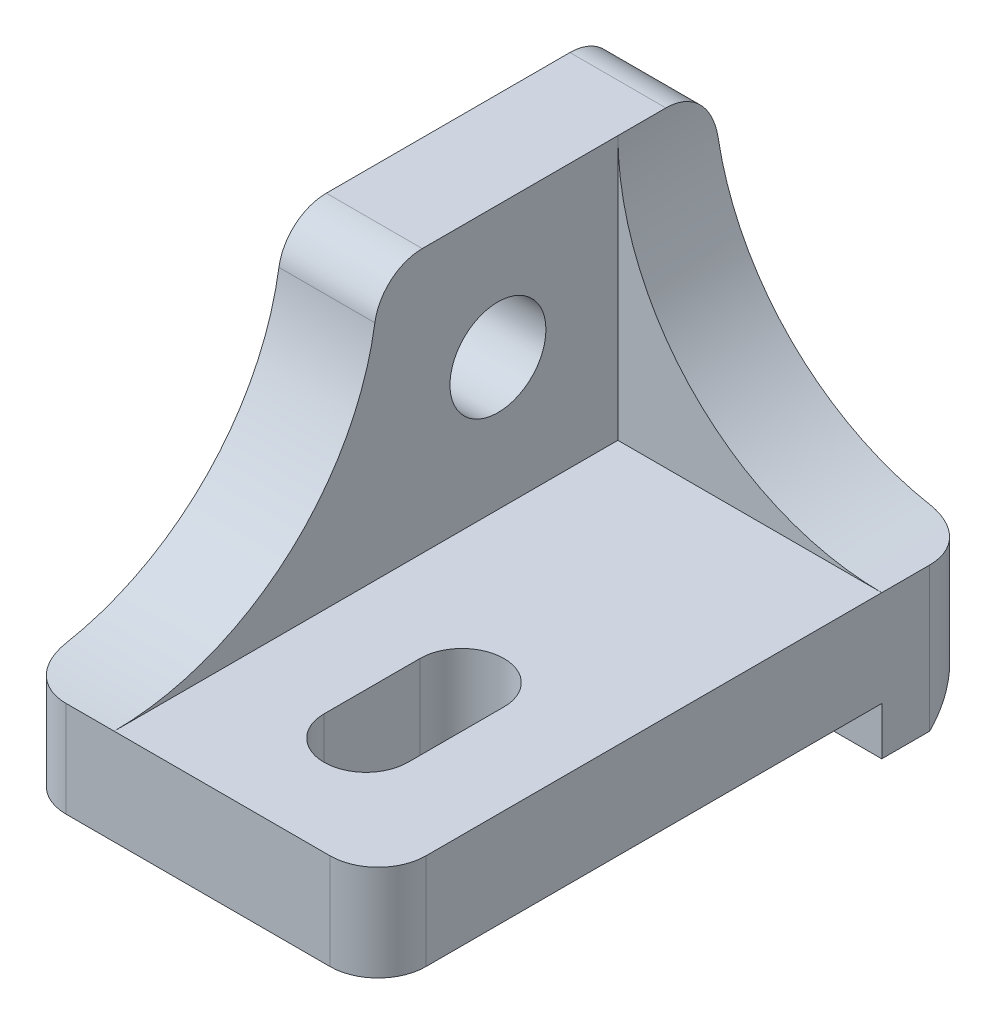
ISO-10303-21;
HEADER;
FILE_DESCRIPTION(('STEP AP214'),'2;1');
FILE_NAME('part.step','',(''),(''),'','','');
FILE_SCHEMA(('AUTOMOTIVE_DESIGN { 1 0 10303 214 1 1 1 1 }'));
ENDSEC;
DATA;
#1=APPLICATION_CONTEXT('core data for automotive mechanical design processes');
#2=APPLICATION_PROTOCOL_DEFINITION('international standard','automotive_design',2000,#1);
#3=PRODUCT_CONTEXT('',#1,'mechanical');
#4=PRODUCT('Part','Part','',(#3));
#5=PRODUCT_RELATED_PRODUCT_CATEGORY('part','',(#4));
#6=PRODUCT_DEFINITION_FORMATION('','',#4);
#7=PRODUCT_DEFINITION_CONTEXT('part definition',#1,'design');
#8=PRODUCT_DEFINITION('design','',#6,#7);
#9=PRODUCT_DEFINITION_SHAPE('','',#8);
#10=(LENGTH_UNIT() NAMED_UNIT(*) SI_UNIT(.MILLI.,.METRE.));
#11=(NAMED_UNIT(*) PLANE_ANGLE_UNIT() SI_UNIT($,.RADIAN.));
#12=(NAMED_UNIT(*) SI_UNIT($,.STERADIAN.) SOLID_ANGLE_UNIT());
#13=UNCERTAINTY_MEASURE_WITH_UNIT(LENGTH_MEASURE(1.E-05),#10,'distance_accuracy_value','');
#14=(GEOMETRIC_REPRESENTATION_CONTEXT(3) GLOBAL_UNCERTAINTY_ASSIGNED_CONTEXT((#13)) GLOBAL_UNIT_ASSIGNED_CONTEXT((#10,
#11,#12)) REPRESENTATION_CONTEXT('',''));
#15=CARTESIAN_POINT('',(0.,0.,0.));
#16=DIRECTION('',(0.,0.,1.));
#17=DIRECTION('',(1.,0.,0.));
#18=AXIS2_PLACEMENT_3D('',#15,#16,#17);
#19=CARTESIAN_POINT('',(0.,4.,25.));
#20=DIRECTION('',(-1.,0.,0.));
#21=DIRECTION('',(0.,0.,1.));
#22=AXIS2_PLACEMENT_3D('',#19,#20,#21);
#23=PLANE('',#22);
#24=DIRECTION('',(0.,0.,-1.));
#25=VECTOR('',#24,1.);
#26=CARTESIAN_POINT('',(0.,-2.,4.));
#27=LINE('',#26,#25);
#28=CARTESIAN_POINT('',(0.,-2.,4.));
#29=VERTEX_POINT('',#28);
#30=CARTESIAN_POINT('',(0.,-2.,2.));
#31=VERTEX_POINT('',#30);
#32=EDGE_CURVE('E505',#29,#31,#27,.T.);
#33=ORIENTED_EDGE('',*,*,#32,.T.);
#34=DIRECTION('',(0.,1.,0.));
#35=VECTOR('',#34,1.);
#36=CARTESIAN_POINT('',(0.,4.,2.));
#37=LINE('',#36,#35);
#38=CARTESIAN_POINT('',(0.,4.,2.));
#39=VERTEX_POINT('',#38);
#40=EDGE_CURVE('E308',#31,#39,#37,.T.);
#41=ORIENTED_EDGE('',*,*,#40,.T.);
#42=DIRECTION('',(0.,0.,-1.));
#43=VECTOR('',#42,1.);
#44=CARTESIAN_POINT('',(0.,4.,4.));
#45=LINE('',#44,#43);
#46=CARTESIAN_POINT('',(0.,4.,4.));
#47=VERTEX_POINT('',#46);
#48=EDGE_CURVE('E543',#47,#39,#45,.T.);
#49=ORIENTED_EDGE('',*,*,#48,.F.);
#50=DIRECTION('',(0.,0.,-1.));
#51=VECTOR('',#50,1.);
#52=CARTESIAN_POINT('',(0.,4.,25.));
#53=LINE('',#52,#51);
#54=CARTESIAN_POINT('',(0.,4.,23.));
#55=VERTEX_POINT('',#54);
#56=EDGE_CURVE('E241',#55,#47,#53,.T.);
#57=ORIENTED_EDGE('',*,*,#56,.F.);
#58=DIRECTION('',(0.,1.,0.));
#59=VECTOR('',#58,1.);
#60=CARTESIAN_POINT('',(0.,4.,23.));
#61=LINE('',#60,#59);
#62=CARTESIAN_POINT('',(0.,0.,23.));
#63=VERTEX_POINT('',#62);
#64=EDGE_CURVE('E284',#55,#63,#61,.F.);
#65=ORIENTED_EDGE('',*,*,#64,.T.);
#66=DIRECTION('',(0.,0.,-1.));
#67=VECTOR('',#66,1.);
#68=CARTESIAN_POINT('',(0.,0.,25.));
#69=LINE('',#68,#67);
#70=CARTESIAN_POINT('',(0.,0.,4.));
#71=VERTEX_POINT('',#70);
#72=EDGE_CURVE('E426',#63,#71,#69,.T.);
#73=ORIENTED_EDGE('',*,*,#72,.T.);
#74=DIRECTION('',(0.,-1.,0.));
#75=VECTOR('',#74,1.);
#76=CARTESIAN_POINT('',(0.,0.,4.));
#77=LINE('',#76,#75);
#78=EDGE_CURVE('E494',#71,#29,#77,.T.);
#79=ORIENTED_EDGE('',*,*,#78,.T.);
#80=EDGE_LOOP('',(#33,#41,#49,#57,#65,#73,#79));
#81=FACE_BOUND('',#80,.T.);
#82=ADVANCED_FACE('F38',(#81),#23,.F.);
#83=CARTESIAN_POINT('',(-11.,4.,25.));
#84=DIRECTION('',(0.,-1.,0.));
#85=DIRECTION('',(0.,0.,-1.));
#86=AXIS2_PLACEMENT_3D('',#83,#84,#85);
#87=PLANE('',#86);
#88=DIRECTION('',(0.,0.,-1.));
#89=VECTOR('',#88,1.);
#90=CARTESIAN_POINT('',(-3.75,4.,20.));
#91=LINE('',#90,#89);
#92=CARTESIAN_POINT('',(-3.75,4.,20.));
#93=VERTEX_POINT('',#92);
#94=CARTESIAN_POINT('',(-3.75,4.,16.));
#95=VERTEX_POINT('',#94);
#96=EDGE_CURVE('E614',#93,#95,#91,.T.);
#97=ORIENTED_EDGE('',*,*,#96,.F.);
#98=CARTESIAN_POINT('',(-5.5,4.,20.));
#99=DIRECTION('',(0.,1.,0.));
#100=DIRECTION('',(0.,0.,1.));
#101=AXIS2_PLACEMENT_3D('',#98,#99,#100);
#102=CIRCLE('',#101,1.75);
#103=CARTESIAN_POINT('',(-7.25,4.,20.));
#104=VERTEX_POINT('',#103);
#105=EDGE_CURVE('E609',#104,#93,#102,.T.);
#106=ORIENTED_EDGE('',*,*,#105,.F.);
#107=DIRECTION('',(0.,0.,1.));
#108=VECTOR('',#107,1.);
#109=CARTESIAN_POINT('',(-7.25,4.,20.));
#110=LINE('',#109,#108);
#111=CARTESIAN_POINT('',(-7.25,4.,16.));
#112=VERTEX_POINT('',#111);
#113=EDGE_CURVE('E622',#112,#104,#110,.T.);
#114=ORIENTED_EDGE('',*,*,#113,.F.);
#115=CARTESIAN_POINT('',(-5.5,4.,16.));
#116=DIRECTION('',(0.,1.,0.));
#117=DIRECTION('',(0.,0.,1.));
#118=AXIS2_PLACEMENT_3D('',#115,#116,#117);
#119=CIRCLE('',#118,1.75);
#120=EDGE_CURVE('E618',#95,#112,#119,.T.);
#121=ORIENTED_EDGE('',*,*,#120,.F.);
#122=EDGE_LOOP('',(#97,#106,#114,#121));
#123=FACE_BOUND('',#122,.T.);
#124=DIRECTION('',(-1.,0.,0.));
#125=VECTOR('',#124,1.);
#126=CARTESIAN_POINT('',(-11.,4.,25.));
#127=LINE('',#126,#125);
#128=CARTESIAN_POINT('',(-2.,4.,25.));
#129=VERTEX_POINT('',#128);
#130=CARTESIAN_POINT('',(-11.,4.,25.));
#131=VERTEX_POINT('',#130);
#132=EDGE_CURVE('E217',#129,#131,#127,.T.);
#133=ORIENTED_EDGE('',*,*,#132,.F.);
#134=CARTESIAN_POINT('',(-2.,4.,23.));
#135=DIRECTION('',(0.,-1.,0.));
#136=DIRECTION('',(0.,0.,-1.));
#137=AXIS2_PLACEMENT_3D('',#134,#135,#136);
#138=CIRCLE('',#137,2.);
#139=EDGE_CURVE('E281',#129,#55,#138,.F.);
#140=ORIENTED_EDGE('',*,*,#139,.T.);
#141=ORIENTED_EDGE('',*,*,#56,.T.);
#142=DIRECTION('',(-1.,0.,0.));
#143=VECTOR('',#142,1.);
#144=CARTESIAN_POINT('',(0.,4.,4.));
#145=LINE('',#144,#143);
#146=CARTESIAN_POINT('',(-11.,4.,4.));
#147=VERTEX_POINT('',#146);
#148=EDGE_CURVE('E239',#47,#147,#145,.T.);
#149=ORIENTED_EDGE('',*,*,#148,.T.);
#150=DIRECTION('',(0.,0.,-1.));
#151=VECTOR('',#150,1.);
#152=CARTESIAN_POINT('',(-11.,4.,25.));
#153=LINE('',#152,#151);
#154=EDGE_CURVE('E232',#131,#147,#153,.T.);
#155=ORIENTED_EDGE('',*,*,#154,.F.);
#156=EDGE_LOOP('',(#133,#140,#141,#149,#155));
#157=FACE_BOUND('',#156,.T.);
#158=ADVANCED_FACE('F237',(#123,#157),#87,.F.);
#159=CARTESIAN_POINT('',(-11.,15.,25.));
#160=DIRECTION('',(-1.,0.,0.));
#161=DIRECTION('',(0.,0.,1.));
#162=AXIS2_PLACEMENT_3D('',#159,#160,#161);
#163=PLANE('',#162);
#164=CARTESIAN_POINT('',(-11.,9.5,9.));
#165=DIRECTION('',(1.,0.,0.));
#166=DIRECTION('',(0.,0.,-1.));
#167=AXIS2_PLACEMENT_3D('',#164,#165,#166);
#168=CIRCLE('',#167,2.);
#169=CARTESIAN_POINT('',(-11.,9.5,7.));
#170=VERTEX_POINT('',#169);
#171=EDGE_CURVE('E212',#170,#170,#168,.T.);
#172=ORIENTED_EDGE('',*,*,#171,.F.);
#173=EDGE_LOOP('',(#172));
#174=FACE_BOUND('',#173,.T.);
#175=DIRECTION('',(0.,0.,-1.));
#176=VECTOR('',#175,1.);
#177=CARTESIAN_POINT('',(-11.,15.,25.));
#178=LINE('',#177,#176);
#179=CARTESIAN_POINT('',(-11.,15.,12.1547674213349));
#180=VERTEX_POINT('',#179);
#181=CARTESIAN_POINT('',(-11.,15.,4.));
#182=VERTEX_POINT('',#181);
#183=EDGE_CURVE('E242',#180,#182,#178,.T.);
#184=ORIENTED_EDGE('',*,*,#183,.F.);
#185=CARTESIAN_POINT('',(-11.,13.,12.1547674213349));
#186=DIRECTION('',(-1.,0.,0.));
#187=DIRECTION('',(0.,0.,1.));
#188=AXIS2_PLACEMENT_3D('',#185,#186,#187);
#189=CIRCLE('',#188,2.);
#190=CARTESIAN_POINT('',(-11.,13.3076923076923,14.1309570488218));
#191=VERTEX_POINT('',#190);
#192=EDGE_CURVE('E234',#180,#191,#189,.F.);
#193=ORIENTED_EDGE('',*,*,#192,.T.);
#194=CARTESIAN_POINT('',(-11.,15.,25.));
#195=DIRECTION('',(1.,0.,0.));
#196=DIRECTION('',(0.,0.,1.));
#197=AXIS2_PLACEMENT_3D('',#194,#195,#196);
#198=CIRCLE('',#197,11.);
#199=EDGE_CURVE('E204',#131,#191,#198,.T.);
#200=ORIENTED_EDGE('',*,*,#199,.F.);
#201=ORIENTED_EDGE('',*,*,#154,.T.);
#202=DIRECTION('',(0.,1.,0.));
#203=VECTOR('',#202,1.);
#204=CARTESIAN_POINT('',(-11.,4.,4.));
#205=LINE('',#204,#203);
#206=EDGE_CURVE('E540',#147,#182,#205,.T.);
#207=ORIENTED_EDGE('',*,*,#206,.T.);
#208=EDGE_LOOP('',(#184,#193,#200,#201,#207));
#209=FACE_BOUND('',#208,.T.);
#210=ADVANCED_FACE('F230',(#174,#209),#163,.F.);
#211=CARTESIAN_POINT('',(-15.,15.,25.));
#212=DIRECTION('',(0.,-1.,0.));
#213=DIRECTION('',(0.,0.,-1.));
#214=AXIS2_PLACEMENT_3D('',#211,#212,#213);
#215=PLANE('',#214);
#216=DIRECTION('',(0.,0.,-1.));
#217=VECTOR('',#216,1.);
#218=CARTESIAN_POINT('',(-11.,15.,4.));
#219=LINE('',#218,#217);
#220=CARTESIAN_POINT('',(-11.,15.,2.));
#221=VERTEX_POINT('',#220);
#222=EDGE_CURVE('E546',#182,#221,#219,.T.);
#223=ORIENTED_EDGE('',*,*,#222,.T.);
#224=DIRECTION('',(-1.,0.,0.));
#225=VECTOR('',#224,1.);
#226=CARTESIAN_POINT('',(-15.,15.,2.));
#227=LINE('',#226,#225);
#228=CARTESIAN_POINT('',(-15.,15.,2.));
#229=VERTEX_POINT('',#228);
#230=EDGE_CURVE('E450',#221,#229,#227,.T.);
#231=ORIENTED_EDGE('',*,*,#230,.T.);
#232=DIRECTION('',(0.,0.,-1.));
#233=VECTOR('',#232,1.);
#234=CARTESIAN_POINT('',(-15.,15.,25.));
#235=LINE('',#234,#233);
#236=CARTESIAN_POINT('',(-15.,15.,12.1547674213349));
#237=VERTEX_POINT('',#236);
#238=EDGE_CURVE('E248',#237,#229,#235,.T.);
#239=ORIENTED_EDGE('',*,*,#238,.F.);
#240=DIRECTION('',(1.,0.,0.));
#241=VECTOR('',#240,1.);
#242=CARTESIAN_POINT('',(-15.,15.,12.1547674213349));
#243=LINE('',#242,#241);
#244=EDGE_CURVE('E267',#237,#180,#243,.T.);
#245=ORIENTED_EDGE('',*,*,#244,.T.);
#246=ORIENTED_EDGE('',*,*,#183,.T.);
#247=EDGE_LOOP('',(#223,#231,#239,#245,#246));
#248=FACE_BOUND('',#247,.T.);
#249=ADVANCED_FACE('F448',(#248),#215,.F.);
#250=CARTESIAN_POINT('',(-15.,0.,25.));
#251=DIRECTION('',(1.,0.,0.));
#252=DIRECTION('',(0.,0.,-1.));
#253=AXIS2_PLACEMENT_3D('',#250,#251,#252);
#254=PLANE('',#253);
#255=CARTESIAN_POINT('',(-15.,9.5,9.));
#256=DIRECTION('',(1.,0.,0.));
#257=DIRECTION('',(0.,0.,-1.));
#258=AXIS2_PLACEMENT_3D('',#255,#256,#257);
#259=CIRCLE('',#258,2.);
#260=CARTESIAN_POINT('',(-15.,9.5,7.));
#261=VERTEX_POINT('',#260);
#262=EDGE_CURVE('E605',#261,#261,#259,.T.);
#263=ORIENTED_EDGE('',*,*,#262,.T.);
#264=EDGE_LOOP('',(#263));
#265=FACE_BOUND('',#264,.T.);
#266=ORIENTED_EDGE('',*,*,#238,.T.);
#267=CARTESIAN_POINT('',(-15.,13.,2.));
#268=DIRECTION('',(1.,0.,0.));
#269=DIRECTION('',(0.,0.,-1.));
#270=AXIS2_PLACEMENT_3D('',#267,#268,#269);
#271=CIRCLE('',#270,2.);
#272=CARTESIAN_POINT('',(-15.,13.,0.));
#273=VERTEX_POINT('',#272);
#274=EDGE_CURVE('E67',#229,#273,#271,.F.);
#275=ORIENTED_EDGE('',*,*,#274,.T.);
#276=DIRECTION('',(0.,-1.,0.));
#277=VECTOR('',#276,1.);
#278=CARTESIAN_POINT('',(-15.,0.,0.));
#279=LINE('',#278,#277);
#280=CARTESIAN_POINT('',(-15.,0.,0.));
#281=VERTEX_POINT('',#280);
#282=EDGE_CURVE('E549',#273,#281,#279,.T.);
#283=ORIENTED_EDGE('',*,*,#282,.T.);
#284=DIRECTION('',(0.,0.707106781186547,-0.707106781186548));
#285=VECTOR('',#284,1.);
#286=CARTESIAN_POINT('',(-15.,-2.,2.));
#287=LINE('',#286,#285);
#288=CARTESIAN_POINT('',(-15.,-2.,2.));
#289=VERTEX_POINT('',#288);
#290=EDGE_CURVE('E464',#289,#281,#287,.T.);
#291=ORIENTED_EDGE('',*,*,#290,.F.);
#292=DIRECTION('',(0.,0.,-1.));
#293=VECTOR('',#292,1.);
#294=CARTESIAN_POINT('',(-15.,-2.,4.));
#295=LINE('',#294,#293);
#296=CARTESIAN_POINT('',(-15.,-2.,4.));
#297=VERTEX_POINT('',#296);
#298=EDGE_CURVE('E462',#297,#289,#295,.T.);
#299=ORIENTED_EDGE('',*,*,#298,.F.);
#300=DIRECTION('',(0.,-1.,0.));
#301=VECTOR('',#300,1.);
#302=CARTESIAN_POINT('',(-15.,0.,4.));
#303=LINE('',#302,#301);
#304=CARTESIAN_POINT('',(-15.,0.,4.));
#305=VERTEX_POINT('',#304);
#306=EDGE_CURVE('E459',#305,#297,#303,.T.);
#307=ORIENTED_EDGE('',*,*,#306,.F.);
#308=DIRECTION('',(0.,0.,-1.));
#309=VECTOR('',#308,1.);
#310=CARTESIAN_POINT('',(-15.,0.,25.));
#311=LINE('',#310,#309);
#312=CARTESIAN_POINT('',(-15.,0.,23.));
#313=VERTEX_POINT('',#312);
#314=EDGE_CURVE('E432',#313,#305,#311,.T.);
#315=ORIENTED_EDGE('',*,*,#314,.F.);
#316=DIRECTION('',(0.,-1.,0.));
#317=VECTOR('',#316,1.);
#318=CARTESIAN_POINT('',(-15.,0.,23.));
#319=LINE('',#318,#317);
#320=CARTESIAN_POINT('',(-15.,4.18334617360803,23.));
#321=VERTEX_POINT('',#320);
#322=EDGE_CURVE('E297',#313,#321,#319,.F.);
#323=ORIENTED_EDGE('',*,*,#322,.T.);
#324=CARTESIAN_POINT('',(-15.,15.,25.));
#325=DIRECTION('',(1.,0.,0.));
#326=DIRECTION('',(0.,0.,1.));
#327=AXIS2_PLACEMENT_3D('',#324,#325,#326);
#328=CIRCLE('',#327,11.);
#329=CARTESIAN_POINT('',(-15.,13.3076923076923,14.1309570488218));
#330=VERTEX_POINT('',#329);
#331=EDGE_CURVE('E213',#321,#330,#328,.T.);
#332=ORIENTED_EDGE('',*,*,#331,.T.);
#333=CARTESIAN_POINT('',(-15.,13.,12.1547674213349));
#334=DIRECTION('',(1.,0.,0.));
#335=DIRECTION('',(0.,0.,-1.));
#336=AXIS2_PLACEMENT_3D('',#333,#334,#335);
#337=CIRCLE('',#336,2.);
#338=EDGE_CURVE('E276',#330,#237,#337,.F.);
#339=ORIENTED_EDGE('',*,*,#338,.T.);
#340=EDGE_LOOP('',(#266,#275,#283,#291,#299,#307,#315,#323,#332,#339));
#341=FACE_BOUND('',#340,.T.);
#342=ADVANCED_FACE('F442',(#265,#341),#254,.F.);
#343=CARTESIAN_POINT('',(0.,0.,25.));
#344=DIRECTION('',(0.,1.,0.));
#345=DIRECTION('',(0.,0.,1.));
#346=AXIS2_PLACEMENT_3D('',#343,#344,#345);
#347=PLANE('',#346);
#348=DIRECTION('',(0.,0.,1.));
#349=VECTOR('',#348,1.);
#350=CARTESIAN_POINT('',(-7.25,0.,25.));
#351=LINE('',#350,#349);
#352=CARTESIAN_POINT('',(-7.25,0.,16.));
#353=VERTEX_POINT('',#352);
#354=CARTESIAN_POINT('',(-7.25,0.,20.));
#355=VERTEX_POINT('',#354);
#356=EDGE_CURVE('E259',#353,#355,#351,.T.);
#357=ORIENTED_EDGE('',*,*,#356,.T.);
#358=CARTESIAN_POINT('',(-5.5,0.,20.));
#359=DIRECTION('',(0.,1.,0.));
#360=DIRECTION('',(0.,0.,1.));
#361=AXIS2_PLACEMENT_3D('',#358,#359,#360);
#362=CIRCLE('',#361,1.75);
#363=CARTESIAN_POINT('',(-3.75,0.,20.));
#364=VERTEX_POINT('',#363);
#365=EDGE_CURVE('E263',#355,#364,#362,.T.);
#366=ORIENTED_EDGE('',*,*,#365,.T.);
#367=DIRECTION('',(0.,0.,-1.));
#368=VECTOR('',#367,1.);
#369=CARTESIAN_POINT('',(-3.75,0.,25.));
#370=LINE('',#369,#368);
#371=CARTESIAN_POINT('',(-3.75,0.,16.));
#372=VERTEX_POINT('',#371);
#373=EDGE_CURVE('E246',#364,#372,#370,.T.);
#374=ORIENTED_EDGE('',*,*,#373,.T.);
#375=CARTESIAN_POINT('',(-5.5,0.,16.));
#376=DIRECTION('',(0.,1.,0.));
#377=DIRECTION('',(0.,0.,1.));
#378=AXIS2_PLACEMENT_3D('',#375,#376,#377);
#379=CIRCLE('',#378,1.75);
#380=EDGE_CURVE('E255',#372,#353,#379,.T.);
#381=ORIENTED_EDGE('',*,*,#380,.T.);
#382=EDGE_LOOP('',(#357,#366,#374,#381));
#383=FACE_BOUND('',#382,.T.);
#384=DIRECTION('',(1.,0.,0.));
#385=VECTOR('',#384,1.);
#386=CARTESIAN_POINT('',(0.,0.,25.));
#387=LINE('',#386,#385);
#388=CARTESIAN_POINT('',(-13.,0.,25.));
#389=VERTEX_POINT('',#388);
#390=CARTESIAN_POINT('',(-2.,0.,25.));
#391=VERTEX_POINT('',#390);
#392=EDGE_CURVE('E224',#389,#391,#387,.T.);
#393=ORIENTED_EDGE('',*,*,#392,.F.);
#394=CARTESIAN_POINT('',(-13.,0.,23.));
#395=DIRECTION('',(0.,1.,0.));
#396=DIRECTION('',(0.,0.,1.));
#397=AXIS2_PLACEMENT_3D('',#394,#395,#396);
#398=CIRCLE('',#397,2.);
#399=EDGE_CURVE('E294',#389,#313,#398,.F.);
#400=ORIENTED_EDGE('',*,*,#399,.T.);
#401=ORIENTED_EDGE('',*,*,#314,.T.);
#402=DIRECTION('',(1.,0.,0.));
#403=VECTOR('',#402,1.);
#404=CARTESIAN_POINT('',(-15.,0.,4.));
#405=LINE('',#404,#403);
#406=CARTESIAN_POINT('',(-11.,0.,4.));
#407=VERTEX_POINT('',#406);
#408=EDGE_CURVE('E468',#305,#407,#405,.T.);
#409=ORIENTED_EDGE('',*,*,#408,.T.);
#410=DIRECTION('',(0.,0.,1.));
#411=VECTOR('',#410,1.);
#412=CARTESIAN_POINT('',(-11.,0.,0.));
#413=LINE('',#412,#411);
#414=CARTESIAN_POINT('',(-11.,0.,0.));
#415=VERTEX_POINT('',#414);
#416=EDGE_CURVE('E479',#415,#407,#413,.T.);
#417=ORIENTED_EDGE('',*,*,#416,.F.);
#418=DIRECTION('',(1.,0.,0.));
#419=VECTOR('',#418,1.);
#420=CARTESIAN_POINT('',(0.,0.,0.));
#421=LINE('',#420,#419);
#422=CARTESIAN_POINT('',(-4.,0.,0.));
#423=VERTEX_POINT('',#422);
#424=EDGE_CURVE('E553',#415,#423,#421,.T.);
#425=ORIENTED_EDGE('',*,*,#424,.T.);
#426=DIRECTION('',(0.,0.,1.));
#427=VECTOR('',#426,1.);
#428=CARTESIAN_POINT('',(-4.,0.,0.));
#429=LINE('',#428,#427);
#430=CARTESIAN_POINT('',(-4.,0.,4.));
#431=VERTEX_POINT('',#430);
#432=EDGE_CURVE('E504',#423,#431,#429,.T.);
#433=ORIENTED_EDGE('',*,*,#432,.T.);
#434=DIRECTION('',(1.,0.,0.));
#435=VECTOR('',#434,1.);
#436=CARTESIAN_POINT('',(-4.,0.,4.));
#437=LINE('',#436,#435);
#438=EDGE_CURVE('E428',#431,#71,#437,.T.);
#439=ORIENTED_EDGE('',*,*,#438,.T.);
#440=ORIENTED_EDGE('',*,*,#72,.F.);
#441=CARTESIAN_POINT('',(-2.,0.,23.));
#442=DIRECTION('',(0.,1.,0.));
#443=DIRECTION('',(0.,0.,1.));
#444=AXIS2_PLACEMENT_3D('',#441,#442,#443);
#445=CIRCLE('',#444,2.);
#446=EDGE_CURVE('E287',#63,#391,#445,.F.);
#447=ORIENTED_EDGE('',*,*,#446,.T.);
#448=EDGE_LOOP('',(#393,#400,#401,#409,#417,#425,#433,#439,#440,#447));
#449=FACE_BOUND('',#448,.T.);
#450=ADVANCED_FACE('F424',(#383,#449),#347,.F.);
#451=CARTESIAN_POINT('',(0.,0.,25.));
#452=DIRECTION('',(0.,0.,-1.));
#453=DIRECTION('',(-1.,0.,0.));
#454=AXIS2_PLACEMENT_3D('',#451,#452,#453);
#455=PLANE('',#454);
#456=DIRECTION('',(1.,0.,0.));
#457=VECTOR('',#456,1.);
#458=CARTESIAN_POINT('',(-15.,4.,25.));
#459=LINE('',#458,#457);
#460=CARTESIAN_POINT('',(-13.,4.,25.));
#461=VERTEX_POINT('',#460);
#462=EDGE_CURVE('E198',#461,#131,#459,.T.);
#463=ORIENTED_EDGE('',*,*,#462,.F.);
#464=DIRECTION('',(0.,-1.,0.));
#465=VECTOR('',#464,1.);
#466=CARTESIAN_POINT('',(-13.,0.,25.));
#467=LINE('',#466,#465);
#468=EDGE_CURVE('E291',#461,#389,#467,.T.);
#469=ORIENTED_EDGE('',*,*,#468,.T.);
#470=ORIENTED_EDGE('',*,*,#392,.T.);
#471=DIRECTION('',(0.,1.,0.));
#472=VECTOR('',#471,1.);
#473=CARTESIAN_POINT('',(-2.,0.,25.));
#474=LINE('',#473,#472);
#475=EDGE_CURVE('E220',#391,#129,#474,.T.);
#476=ORIENTED_EDGE('',*,*,#475,.T.);
#477=ORIENTED_EDGE('',*,*,#132,.T.);
#478=EDGE_LOOP('',(#463,#469,#470,#476,#477));
#479=FACE_BOUND('',#478,.T.);
#480=ADVANCED_FACE('F218',(#479),#455,.F.);
#481=CARTESIAN_POINT('',(0.,0.,0.));
#482=DIRECTION('',(0.,0.,-1.));
#483=DIRECTION('',(-1.,0.,0.));
#484=AXIS2_PLACEMENT_3D('',#481,#482,#483);
#485=PLANE('',#484);
#486=ORIENTED_EDGE('',*,*,#282,.F.);
#487=DIRECTION('',(-1.,0.,0.));
#488=VECTOR('',#487,1.);
#489=CARTESIAN_POINT('',(-11.,13.,0.));
#490=LINE('',#489,#488);
#491=CARTESIAN_POINT('',(-10.816653826392,13.,0.));
#492=VERTEX_POINT('',#491);
#493=EDGE_CURVE('E53',#273,#492,#490,.F.);
#494=ORIENTED_EDGE('',*,*,#493,.T.);
#495=CARTESIAN_POINT('',(0.,15.,0.));
#496=DIRECTION('',(0.,0.,1.));
#497=DIRECTION('',(1.,0.,0.));
#498=AXIS2_PLACEMENT_3D('',#495,#496,#497);
#499=CIRCLE('',#498,11.);
#500=CARTESIAN_POINT('',(-2.,4.18334617360803,0.));
#501=VERTEX_POINT('',#500);
#502=EDGE_CURVE('E525',#492,#501,#499,.T.);
#503=ORIENTED_EDGE('',*,*,#502,.T.);
#504=DIRECTION('',(0.,1.,0.));
#505=VECTOR('',#504,1.);
#506=CARTESIAN_POINT('',(-2.,0.,0.));
#507=LINE('',#506,#505);
#508=CARTESIAN_POINT('',(-2.,0.,0.));
#509=VERTEX_POINT('',#508);
#510=EDGE_CURVE('E388',#501,#509,#507,.F.);
#511=ORIENTED_EDGE('',*,*,#510,.T.);
#512=DIRECTION('',(1.,0.,0.));
#513=VECTOR('',#512,1.);
#514=CARTESIAN_POINT('',(-4.,0.,0.));
#515=LINE('',#514,#513);
#516=EDGE_CURVE('E516',#423,#509,#515,.T.);
#517=ORIENTED_EDGE('',*,*,#516,.F.);
#518=ORIENTED_EDGE('',*,*,#424,.F.);
#519=EDGE_CURVE('E225',#281,#415,#421,.T.);
#520=ORIENTED_EDGE('',*,*,#519,.F.);
#521=EDGE_LOOP('',(#486,#494,#503,#511,#517,#518,#520));
#522=FACE_BOUND('',#521,.T.);
#523=ADVANCED_FACE('F376',(#522),#485,.T.);
#524=CARTESIAN_POINT('',(0.,15.,4.));
#525=DIRECTION('',(0.,0.,-1.));
#526=DIRECTION('',(-1.,0.,0.));
#527=AXIS2_PLACEMENT_3D('',#524,#525,#526);
#528=CYLINDRICAL_SURFACE('',#527,11.);
#529=ORIENTED_EDGE('',*,*,#502,.F.);
#530=CARTESIAN_POINT('',(-10.816653826392,13.,0.));
#531=CARTESIAN_POINT('',(-10.8268707618934,13.0552441109413,3.4789031830337E-07));
#532=CARTESIAN_POINT('',(-10.8366550830372,13.1105436369617,0.00229058738982731));
#533=CARTESIAN_POINT('',(-10.8553206842143,13.2209161475963,0.0114662675246961));
#534=CARTESIAN_POINT('',(-10.864201911942,13.2759891189116,0.0183519741472465));
#535=CARTESIAN_POINT('',(-10.8894085036759,13.4401959511195,0.045898773806843));
#536=CARTESIAN_POINT('',(-10.9043261779001,13.5484774870717,0.0734494791025257));
#537=CARTESIAN_POINT('',(-10.9303362052317,13.7594009161403,0.146411088675046));
#538=CARTESIAN_POINT('',(-10.941424722882,13.862037068596,0.1918398035154));
#539=CARTESIAN_POINT('',(-10.9600772218024,14.058488823527,0.299374038214162));
#540=CARTESIAN_POINT('',(-10.9676424206865,14.1523074642617,0.361473785063439));
#541=CARTESIAN_POINT('',(-10.9797770300573,14.3275676426441,0.5000201536861));
#542=CARTESIAN_POINT('',(-10.984371556046,14.4091083511206,0.576339276777348));
#543=CARTESIAN_POINT('',(-10.991388214833,14.5584273627049,0.741547417078303));
#544=CARTESIAN_POINT('',(-10.9938097831373,14.6262020861292,0.830439693621576));
#545=CARTESIAN_POINT('',(-10.9972381774659,14.7462552839654,1.01862295221984));
#546=CARTESIAN_POINT('',(-10.9982396265315,14.7984742741224,1.11795193482118));
#547=CARTESIAN_POINT('',(-10.999491541304,14.8855772214891,1.32391951118288));
#548=CARTESIAN_POINT('',(-10.9997423863952,14.920469928633,1.43055438437381));
#549=CARTESIAN_POINT('',(-10.9999560216492,14.9640793696796,1.61475307508974));
#550=CARTESIAN_POINT('',(-10.9999834636147,14.9775385631379,1.69122908364014));
#551=CARTESIAN_POINT('',(-11.0000000187302,14.9954998041463,1.845126533926));
#552=CARTESIAN_POINT('',(-10.9999891807229,15.000013254369,1.92254664537713));
#553=CARTESIAN_POINT('',(-11.,15.,2.));
#554=B_SPLINE_CURVE_WITH_KNOTS('',3,(#530,#531,#532,#533,#534,#535,#536,#537,#538,#539,#540,
#541,#542,#543,#544,#545,#546,#547,#548,#549,#550,#551,#552,#553),.UNSPECIFIED.,.F.,.F.,(4,2,2,
2,2,2,2,2,2,2,2,4),(0.,0.168444797477597,0.336899345442662,0.673327253322031,1.01009117181782,
1.34673862248188,1.68050133097172,2.01435071975025,2.34946080880112,2.68440149158751,
2.91686246008855,3.14902693166273),.UNSPECIFIED.);
#555=EDGE_CURVE('E11',#492,#221,#554,.T.);
#556=ORIENTED_EDGE('',*,*,#555,.T.);
#557=ORIENTED_EDGE('',*,*,#222,.F.);
#558=CARTESIAN_POINT('',(0.,15.,4.));
#559=DIRECTION('',(0.,0.,1.));
#560=DIRECTION('',(1.,0.,0.));
#561=AXIS2_PLACEMENT_3D('',#558,#559,#560);
#562=CIRCLE('',#561,11.);
#563=EDGE_CURVE('E534',#182,#47,#562,.T.);
#564=ORIENTED_EDGE('',*,*,#563,.T.);
#565=ORIENTED_EDGE('',*,*,#48,.T.);
#566=CARTESIAN_POINT('',(0.,4.,2.));
#567=CARTESIAN_POINT('',(-3.76548998584262E-07,4.00000248404649,1.94374889939668));
#568=CARTESIAN_POINT('',(-0.00237462832995711,3.99999972068299,1.88752474217222));
#569=CARTESIAN_POINT('',(-0.0118465102778602,4.00000487556501,1.77547842138424));
#570=CARTESIAN_POINT('',(-0.0189439204532553,4.00001279331307,1.71965623922025));
#571=CARTESIAN_POINT('',(-0.0472545916627504,4.00008425213034,1.55348341977433));
#572=CARTESIAN_POINT('',(-0.0754864728544024,4.00019537202224,1.44424523873173));
#573=CARTESIAN_POINT('',(-0.149883747842747,4.00095901628373,1.23205915812139));
#574=CARTESIAN_POINT('',(-0.196058074911649,4.00161181052889,1.12911442155924));
#575=CARTESIAN_POINT('',(-0.305019996081911,4.00409527583718,0.932446686466163));
#576=CARTESIAN_POINT('',(-0.367804745371451,4.00592574528057,0.838722112595785));
#577=CARTESIAN_POINT('',(-0.508081240424605,4.01151699240081,0.663296373681052));
#578=CARTESIAN_POINT('',(-0.585552428479101,4.01527508423481,0.581578682181132));
#579=CARTESIAN_POINT('',(-0.753000178803546,4.02548365118793,0.432337297666665));
#580=CARTESIAN_POINT('',(-0.842977459690564,4.03193428106664,0.36481442086602));
#581=CARTESIAN_POINT('',(-1.03220088073384,4.0481271565993,0.246213278853699));
#582=CARTESIAN_POINT('',(-1.13139229527144,4.05785076746331,0.195045043900428));
#583=CARTESIAN_POINT('',(-1.33651583993647,4.08100952076729,0.109999675234917));
#584=CARTESIAN_POINT('',(-1.44244553968236,4.09444333078026,0.0761163464865249));
#585=CARTESIAN_POINT('',(-1.62414300902492,4.12030519619775,0.0341631645158939));
#586=CARTESIAN_POINT('',(-1.69899355794968,4.13173603854625,0.0213357601202814));
#587=CARTESIAN_POINT('',(-1.84927238037463,4.15629010718178,0.0042540545935215));
#588=CARTESIAN_POINT('',(-1.92469957694875,4.16941067934539,-1.3521146002471E-05));
#589=CARTESIAN_POINT('',(-2.,4.18334617360803,0.));
#590=B_SPLINE_CURVE_WITH_KNOTS('',3,(#566,#567,#568,#569,#570,#571,#572,#573,#574,#575,#576,
#577,#578,#579,#580,#581,#582,#583,#584,#585,#586,#587,#588,#589),.UNSPECIFIED.,.F.,.F.,(4,2,2,
2,2,2,2,2,2,2,2,4),(0.,0.168649691295797,0.337291527908927,0.674038305932978,1.01095296034793,
1.34780994982181,1.68419885119363,2.02060708992553,2.3551314975413,2.6895359247899,
2.91945635188157,3.14901994113586),.UNSPECIFIED.);
#591=EDGE_CURVE('E380',#39,#501,#590,.T.);
#592=ORIENTED_EDGE('',*,*,#591,.T.);
#593=EDGE_LOOP('',(#529,#556,#557,#564,#565,#592));
#594=FACE_BOUND('',#593,.T.);
#595=ADVANCED_FACE('F371',(#594),#528,.F.);
#596=CARTESIAN_POINT('',(0.,15.,4.));
#597=DIRECTION('',(0.,0.,1.));
#598=DIRECTION('',(1.,0.,0.));
#599=AXIS2_PLACEMENT_3D('',#596,#597,#598);
#600=PLANE('',#599);
#601=ORIENTED_EDGE('',*,*,#563,.F.);
#602=ORIENTED_EDGE('',*,*,#206,.F.);
#603=ORIENTED_EDGE('',*,*,#148,.F.);
#604=EDGE_LOOP('',(#601,#602,#603));
#605=FACE_BOUND('',#604,.T.);
#606=ADVANCED_FACE('F368',(#605),#600,.T.);
#607=CARTESIAN_POINT('',(-4.,-2.,2.));
#608=DIRECTION('',(0.,-0.707106781186548,-0.707106781186547));
#609=DIRECTION('',(0.,0.707106781186547,-0.707106781186548));
#610=AXIS2_PLACEMENT_3D('',#607,#608,#609);
#611=PLANE('',#610);
#612=ORIENTED_EDGE('',*,*,#516,.T.);
#613=CARTESIAN_POINT('',(-2.,-2.,2.));
#614=DIRECTION('',(0.,-0.707106781186548,-0.707106781186547));
#615=DIRECTION('',(0.,-0.707106781186547,0.707106781186548));
#616=AXIS2_PLACEMENT_3D('',#613,#614,#615);
#617=ELLIPSE('',#616,2.82842712474619,2.);
#618=EDGE_CURVE('E565',#509,#31,#617,.T.);
#619=ORIENTED_EDGE('',*,*,#618,.T.);
#620=DIRECTION('',(1.,0.,0.));
#621=VECTOR('',#620,1.);
#622=CARTESIAN_POINT('',(-4.,-2.,2.));
#623=LINE('',#622,#621);
#624=CARTESIAN_POINT('',(-4.,-2.,2.));
#625=VERTEX_POINT('',#624);
#626=EDGE_CURVE('E521',#625,#31,#623,.T.);
#627=ORIENTED_EDGE('',*,*,#626,.F.);
#628=DIRECTION('',(0.,0.707106781186547,-0.707106781186548));
#629=VECTOR('',#628,1.);
#630=CARTESIAN_POINT('',(-4.,-2.,2.));
#631=LINE('',#630,#629);
#632=EDGE_CURVE('E500',#625,#423,#631,.T.);
#633=ORIENTED_EDGE('',*,*,#632,.T.);
#634=EDGE_LOOP('',(#612,#619,#627,#633));
#635=FACE_BOUND('',#634,.T.);
#636=ADVANCED_FACE('F361',(#635),#611,.T.);
#637=CARTESIAN_POINT('',(-4.,-2.,4.));
#638=DIRECTION('',(0.,-1.,0.));
#639=DIRECTION('',(0.,0.,-1.));
#640=AXIS2_PLACEMENT_3D('',#637,#638,#639);
#641=PLANE('',#640);
#642=ORIENTED_EDGE('',*,*,#32,.F.);
#643=DIRECTION('',(1.,0.,0.));
#644=VECTOR('',#643,1.);
#645=CARTESIAN_POINT('',(-4.,-2.,4.));
#646=LINE('',#645,#644);
#647=CARTESIAN_POINT('',(-4.,-2.,4.));
#648=VERTEX_POINT('',#647);
#649=EDGE_CURVE('E526',#648,#29,#646,.T.);
#650=ORIENTED_EDGE('',*,*,#649,.F.);
#651=DIRECTION('',(0.,0.,-1.));
#652=VECTOR('',#651,1.);
#653=CARTESIAN_POINT('',(-4.,-2.,4.));
#654=LINE('',#653,#652);
#655=EDGE_CURVE('E512',#648,#625,#654,.T.);
#656=ORIENTED_EDGE('',*,*,#655,.T.);
#657=ORIENTED_EDGE('',*,*,#626,.T.);
#658=EDGE_LOOP('',(#642,#650,#656,#657));
#659=FACE_BOUND('',#658,.T.);
#660=ADVANCED_FACE('F358',(#659),#641,.T.);
#661=CARTESIAN_POINT('',(-4.,0.,4.));
#662=DIRECTION('',(0.,0.,1.));
#663=DIRECTION('',(1.,0.,0.));
#664=AXIS2_PLACEMENT_3D('',#661,#662,#663);
#665=PLANE('',#664);
#666=ORIENTED_EDGE('',*,*,#78,.F.);
#667=ORIENTED_EDGE('',*,*,#438,.F.);
#668=DIRECTION('',(0.,-1.,0.));
#669=VECTOR('',#668,1.);
#670=CARTESIAN_POINT('',(-4.,0.,4.));
#671=LINE('',#670,#669);
#672=EDGE_CURVE('E508',#431,#648,#671,.T.);
#673=ORIENTED_EDGE('',*,*,#672,.T.);
#674=ORIENTED_EDGE('',*,*,#649,.T.);
#675=EDGE_LOOP('',(#666,#667,#673,#674));
#676=FACE_BOUND('',#675,.T.);
#677=ADVANCED_FACE('F356',(#676),#665,.T.);
#678=CARTESIAN_POINT('',(-4.,0.,0.));
#679=DIRECTION('',(1.,0.,0.));
#680=DIRECTION('',(0.,0.,-1.));
#681=AXIS2_PLACEMENT_3D('',#678,#679,#680);
#682=PLANE('',#681);
#683=ORIENTED_EDGE('',*,*,#632,.F.);
#684=ORIENTED_EDGE('',*,*,#655,.F.);
#685=ORIENTED_EDGE('',*,*,#672,.F.);
#686=ORIENTED_EDGE('',*,*,#432,.F.);
#687=EDGE_LOOP('',(#683,#684,#685,#686));
#688=FACE_BOUND('',#687,.T.);
#689=ADVANCED_FACE('F352',(#688),#682,.F.);
#690=CARTESIAN_POINT('',(-15.,-2.,2.));
#691=DIRECTION('',(0.,-0.707106781186548,-0.707106781186547));
#692=DIRECTION('',(0.,0.707106781186547,-0.707106781186548));
#693=AXIS2_PLACEMENT_3D('',#690,#691,#692);
#694=PLANE('',#693);
#695=DIRECTION('',(0.,0.707106781186547,-0.707106781186548));
#696=VECTOR('',#695,1.);
#697=CARTESIAN_POINT('',(-11.,-2.,2.));
#698=LINE('',#697,#696);
#699=CARTESIAN_POINT('',(-11.,-2.,2.));
#700=VERTEX_POINT('',#699);
#701=EDGE_CURVE('E475',#700,#415,#698,.T.);
#702=ORIENTED_EDGE('',*,*,#701,.F.);
#703=DIRECTION('',(1.,0.,0.));
#704=VECTOR('',#703,1.);
#705=CARTESIAN_POINT('',(-15.,-2.,2.));
#706=LINE('',#705,#704);
#707=EDGE_CURVE('E491',#289,#700,#706,.T.);
#708=ORIENTED_EDGE('',*,*,#707,.F.);
#709=ORIENTED_EDGE('',*,*,#290,.T.);
#710=ORIENTED_EDGE('',*,*,#519,.T.);
#711=EDGE_LOOP('',(#702,#708,#709,#710));
#712=FACE_BOUND('',#711,.T.);
#713=ADVANCED_FACE('F345',(#712),#694,.T.);
#714=CARTESIAN_POINT('',(-15.,-2.,4.));
#715=DIRECTION('',(0.,-1.,0.));
#716=DIRECTION('',(0.,0.,-1.));
#717=AXIS2_PLACEMENT_3D('',#714,#715,#716);
#718=PLANE('',#717);
#719=DIRECTION('',(0.,0.,-1.));
#720=VECTOR('',#719,1.);
#721=CARTESIAN_POINT('',(-11.,-2.,4.));
#722=LINE('',#721,#720);
#723=CARTESIAN_POINT('',(-11.,-2.,4.));
#724=VERTEX_POINT('',#723);
#725=EDGE_CURVE('E471',#724,#700,#722,.T.);
#726=ORIENTED_EDGE('',*,*,#725,.F.);
#727=DIRECTION('',(1.,0.,0.));
#728=VECTOR('',#727,1.);
#729=CARTESIAN_POINT('',(-15.,-2.,4.));
#730=LINE('',#729,#728);
#731=EDGE_CURVE('E495',#297,#724,#730,.T.);
#732=ORIENTED_EDGE('',*,*,#731,.F.);
#733=ORIENTED_EDGE('',*,*,#298,.T.);
#734=ORIENTED_EDGE('',*,*,#707,.T.);
#735=EDGE_LOOP('',(#726,#732,#733,#734));
#736=FACE_BOUND('',#735,.T.);
#737=ADVANCED_FACE('F342',(#736),#718,.T.);
#738=CARTESIAN_POINT('',(-15.,0.,4.));
#739=DIRECTION('',(0.,0.,1.));
#740=DIRECTION('',(1.,0.,0.));
#741=AXIS2_PLACEMENT_3D('',#738,#739,#740);
#742=PLANE('',#741);
#743=DIRECTION('',(0.,-1.,0.));
#744=VECTOR('',#743,1.);
#745=CARTESIAN_POINT('',(-11.,0.,4.));
#746=LINE('',#745,#744);
#747=EDGE_CURVE('E484',#407,#724,#746,.T.);
#748=ORIENTED_EDGE('',*,*,#747,.F.);
#749=ORIENTED_EDGE('',*,*,#408,.F.);
#750=ORIENTED_EDGE('',*,*,#306,.T.);
#751=ORIENTED_EDGE('',*,*,#731,.T.);
#752=EDGE_LOOP('',(#748,#749,#750,#751));
#753=FACE_BOUND('',#752,.T.);
#754=ADVANCED_FACE('F340',(#753),#742,.T.);
#755=CARTESIAN_POINT('',(-11.,0.,0.));
#756=DIRECTION('',(1.,0.,0.));
#757=DIRECTION('',(0.,0.,-1.));
#758=AXIS2_PLACEMENT_3D('',#755,#756,#757);
#759=PLANE('',#758);
#760=ORIENTED_EDGE('',*,*,#701,.T.);
#761=ORIENTED_EDGE('',*,*,#416,.T.);
#762=ORIENTED_EDGE('',*,*,#747,.T.);
#763=ORIENTED_EDGE('',*,*,#725,.T.);
#764=EDGE_LOOP('',(#760,#761,#762,#763));
#765=FACE_BOUND('',#764,.T.);
#766=ADVANCED_FACE('F336',(#765),#759,.T.);
#767=CARTESIAN_POINT('',(-5.5,-2.,20.));
#768=DIRECTION('',(0.,1.,0.));
#769=DIRECTION('',(0.,0.,1.));
#770=AXIS2_PLACEMENT_3D('',#767,#768,#769);
#771=CYLINDRICAL_SURFACE('',#770,1.75);
#772=DIRECTION('',(0.,1.,0.));
#773=VECTOR('',#772,1.);
#774=CARTESIAN_POINT('',(-7.25,-2.,20.));
#775=LINE('',#774,#773);
#776=EDGE_CURVE('E480',#355,#104,#775,.T.);
#777=ORIENTED_EDGE('',*,*,#776,.T.);
#778=ORIENTED_EDGE('',*,*,#105,.T.);
#779=DIRECTION('',(0.,1.,0.));
#780=VECTOR('',#779,1.);
#781=CARTESIAN_POINT('',(-3.75,-2.,20.));
#782=LINE('',#781,#780);
#783=EDGE_CURVE('E626',#364,#93,#782,.T.);
#784=ORIENTED_EDGE('',*,*,#783,.F.);
#785=ORIENTED_EDGE('',*,*,#365,.F.);
#786=EDGE_LOOP('',(#777,#778,#784,#785));
#787=FACE_BOUND('',#786,.T.);
#788=ADVANCED_FACE('F326',(#787),#771,.F.);
#789=CARTESIAN_POINT('',(-7.25,-2.,20.));
#790=DIRECTION('',(-1.,0.,0.));
#791=DIRECTION('',(0.,0.,1.));
#792=AXIS2_PLACEMENT_3D('',#789,#790,#791);
#793=PLANE('',#792);
#794=DIRECTION('',(0.,1.,0.));
#795=VECTOR('',#794,1.);
#796=CARTESIAN_POINT('',(-7.25,-2.,16.));
#797=LINE('',#796,#795);
#798=EDGE_CURVE('E629',#353,#112,#797,.T.);
#799=ORIENTED_EDGE('',*,*,#798,.T.);
#800=ORIENTED_EDGE('',*,*,#113,.T.);
#801=ORIENTED_EDGE('',*,*,#776,.F.);
#802=ORIENTED_EDGE('',*,*,#356,.F.);
#803=EDGE_LOOP('',(#799,#800,#801,#802));
#804=FACE_BOUND('',#803,.T.);
#805=ADVANCED_FACE('F322',(#804),#793,.F.);
#806=CARTESIAN_POINT('',(-5.5,-2.,16.));
#807=DIRECTION('',(0.,1.,0.));
#808=DIRECTION('',(0.,0.,1.));
#809=AXIS2_PLACEMENT_3D('',#806,#807,#808);
#810=CYLINDRICAL_SURFACE('',#809,1.75);
#811=DIRECTION('',(0.,1.,0.));
#812=VECTOR('',#811,1.);
#813=CARTESIAN_POINT('',(-3.75,-2.,16.));
#814=LINE('',#813,#812);
#815=EDGE_CURVE('E632',#372,#95,#814,.T.);
#816=ORIENTED_EDGE('',*,*,#815,.T.);
#817=ORIENTED_EDGE('',*,*,#120,.T.);
#818=ORIENTED_EDGE('',*,*,#798,.F.);
#819=ORIENTED_EDGE('',*,*,#380,.F.);
#820=EDGE_LOOP('',(#816,#817,#818,#819));
#821=FACE_BOUND('',#820,.T.);
#822=ADVANCED_FACE('F325',(#821),#810,.F.);
#823=CARTESIAN_POINT('',(-3.75,-2.,20.));
#824=DIRECTION('',(1.,0.,0.));
#825=DIRECTION('',(0.,0.,-1.));
#826=AXIS2_PLACEMENT_3D('',#823,#824,#825);
#827=PLANE('',#826);
#828=ORIENTED_EDGE('',*,*,#783,.T.);
#829=ORIENTED_EDGE('',*,*,#96,.T.);
#830=ORIENTED_EDGE('',*,*,#815,.F.);
#831=ORIENTED_EDGE('',*,*,#373,.F.);
#832=EDGE_LOOP('',(#828,#829,#830,#831));
#833=FACE_BOUND('',#832,.T.);
#834=ADVANCED_FACE('F320',(#833),#827,.F.);
#835=CARTESIAN_POINT('',(-15.,9.5,9.));
#836=DIRECTION('',(1.,0.,0.));
#837=DIRECTION('',(0.,0.,-1.));
#838=AXIS2_PLACEMENT_3D('',#835,#836,#837);
#839=CYLINDRICAL_SURFACE('',#838,2.);
#840=ORIENTED_EDGE('',*,*,#262,.F.);
#841=EDGE_LOOP('',(#840));
#842=FACE_BOUND('',#841,.T.);
#843=ORIENTED_EDGE('',*,*,#171,.T.);
#844=EDGE_LOOP('',(#843));
#845=FACE_BOUND('',#844,.T.);
#846=ADVANCED_FACE('F317',(#842,#845),#839,.F.);
#847=CARTESIAN_POINT('',(-15.,15.,25.));
#848=DIRECTION('',(1.,0.,0.));
#849=DIRECTION('',(0.,0.,-1.));
#850=AXIS2_PLACEMENT_3D('',#847,#848,#849);
#851=CYLINDRICAL_SURFACE('',#850,11.);
#852=ORIENTED_EDGE('',*,*,#331,.F.);
#853=CARTESIAN_POINT('',(-15.,4.18334617360803,23.));
#854=CARTESIAN_POINT('',(-14.9999996521097,4.17312923810661,23.0552441109413));
#855=CARTESIAN_POINT('',(-14.9977094126102,4.16334491696285,23.1105436369617));
#856=CARTESIAN_POINT('',(-14.9885337324753,4.1446793157857,23.2209161475963));
#857=CARTESIAN_POINT('',(-14.9816480258528,4.13579808805796,23.2759891189116));
#858=CARTESIAN_POINT('',(-14.9541012261932,4.11059149632407,23.4401959511195));
#859=CARTESIAN_POINT('',(-14.9265505208975,4.09567382209993,23.5484774870717));
#860=CARTESIAN_POINT('',(-14.853588911325,4.06966379476835,23.7594009161403));
#861=CARTESIAN_POINT('',(-14.8081601964846,4.05857527711795,23.862037068596));
#862=CARTESIAN_POINT('',(-14.7006259617858,4.03992277819756,24.058488823527));
#863=CARTESIAN_POINT('',(-14.6385262149366,4.03235757931355,24.1523074642617));
#864=CARTESIAN_POINT('',(-14.4999798463139,4.02022296994266,24.3275676426441));
#865=CARTESIAN_POINT('',(-14.4236607232227,4.01562844395404,24.4091083511206));
#866=CARTESIAN_POINT('',(-14.2584525829217,4.008611785167,24.5584273627049));
#867=CARTESIAN_POINT('',(-14.1695603063784,4.00619021686272,24.6262020861292));
#868=CARTESIAN_POINT('',(-13.9813770477802,4.00276182253407,24.7462552839654));
#869=CARTESIAN_POINT('',(-13.8820480651788,4.00176037346847,24.7984742741224));
#870=CARTESIAN_POINT('',(-13.6760804888171,4.00050845869603,24.8855772214891));
#871=CARTESIAN_POINT('',(-13.5694456156262,4.00025761360484,24.920469928633));
#872=CARTESIAN_POINT('',(-13.3852469249103,4.00004397835076,24.9640793696796));
#873=CARTESIAN_POINT('',(-13.3087709163599,4.0000165363853,24.9775385631379));
#874=CARTESIAN_POINT('',(-13.154873466074,3.99999998126975,24.9954998041463));
#875=CARTESIAN_POINT('',(-13.0774533546229,4.00001081927707,25.0000132543691));
#876=CARTESIAN_POINT('',(-13.,4.,25.));
#877=B_SPLINE_CURVE_WITH_KNOTS('',3,(#853,#854,#855,#856,#857,#858,#859,#860,#861,#862,#863,
#864,#865,#866,#867,#868,#869,#870,#871,#872,#873,#874,#875,#876),.UNSPECIFIED.,.F.,.F.,(4,2,2,
2,2,2,2,2,2,2,2,4),(0.,0.168444797477599,0.336899345442662,0.673327253322031,1.01009117181782,
1.34673862248188,1.68050133097172,2.01435071975025,2.34946080880112,2.68440149158751,
2.91686246008855,3.14902693166273),.UNSPECIFIED.);
#878=EDGE_CURVE('E207',#321,#461,#877,.T.);
#879=ORIENTED_EDGE('',*,*,#878,.T.);
#880=ORIENTED_EDGE('',*,*,#462,.T.);
#881=ORIENTED_EDGE('',*,*,#199,.T.);
#882=DIRECTION('',(1.,0.,0.));
#883=VECTOR('',#882,1.);
#884=CARTESIAN_POINT('',(-15.,13.3076923076923,14.1309570488218));
#885=LINE('',#884,#883);
#886=EDGE_CURVE('E273',#191,#330,#885,.F.);
#887=ORIENTED_EDGE('',*,*,#886,.T.);
#888=EDGE_LOOP('',(#852,#879,#880,#881,#887));
#889=FACE_BOUND('',#888,.T.);
#890=ADVANCED_FACE('F201',(#889),#851,.F.);
#891=CARTESIAN_POINT('',(-15.,13.,12.1547674213349));
#892=DIRECTION('',(1.,0.,0.));
#893=DIRECTION('',(0.,0.,-1.));
#894=AXIS2_PLACEMENT_3D('',#891,#892,#893);
#895=CYLINDRICAL_SURFACE('',#894,2.);
#896=ORIENTED_EDGE('',*,*,#338,.F.);
#897=ORIENTED_EDGE('',*,*,#886,.F.);
#898=ORIENTED_EDGE('',*,*,#192,.F.);
#899=ORIENTED_EDGE('',*,*,#244,.F.);
#900=EDGE_LOOP('',(#896,#897,#898,#899));
#901=FACE_BOUND('',#900,.T.);
#902=ADVANCED_FACE('F316',(#901),#895,.T.);
#903=CARTESIAN_POINT('',(-2.,0.,23.));
#904=DIRECTION('',(0.,1.,0.));
#905=DIRECTION('',(0.,0.,1.));
#906=AXIS2_PLACEMENT_3D('',#903,#904,#905);
#907=CYLINDRICAL_SURFACE('',#906,2.);
#908=ORIENTED_EDGE('',*,*,#446,.F.);
#909=ORIENTED_EDGE('',*,*,#64,.F.);
#910=ORIENTED_EDGE('',*,*,#139,.F.);
#911=ORIENTED_EDGE('',*,*,#475,.F.);
#912=EDGE_LOOP('',(#908,#909,#910,#911));
#913=FACE_BOUND('',#912,.T.);
#914=ADVANCED_FACE('F399',(#913),#907,.T.);
#915=CARTESIAN_POINT('',(-13.,0.,23.));
#916=DIRECTION('',(0.,-1.,0.));
#917=DIRECTION('',(0.,0.,-1.));
#918=AXIS2_PLACEMENT_3D('',#915,#916,#917);
#919=CYLINDRICAL_SURFACE('',#918,2.);
#920=ORIENTED_EDGE('',*,*,#878,.F.);
#921=ORIENTED_EDGE('',*,*,#322,.F.);
#922=ORIENTED_EDGE('',*,*,#399,.F.);
#923=ORIENTED_EDGE('',*,*,#468,.F.);
#924=EDGE_LOOP('',(#920,#921,#922,#923));
#925=FACE_BOUND('',#924,.T.);
#926=ADVANCED_FACE('F310',(#925),#919,.T.);
#927=CARTESIAN_POINT('',(-2.,4.,2.));
#928=DIRECTION('',(0.,-1.,0.));
#929=DIRECTION('',(0.,0.,-1.));
#930=AXIS2_PLACEMENT_3D('',#927,#928,#929);
#931=CYLINDRICAL_SURFACE('',#930,2.);
#932=ORIENTED_EDGE('',*,*,#618,.F.);
#933=ORIENTED_EDGE('',*,*,#510,.F.);
#934=ORIENTED_EDGE('',*,*,#591,.F.);
#935=ORIENTED_EDGE('',*,*,#40,.F.);
#936=EDGE_LOOP('',(#932,#933,#934,#935));
#937=FACE_BOUND('',#936,.T.);
#938=ADVANCED_FACE('F390',(#937),#931,.T.);
#939=CARTESIAN_POINT('',(-15.,13.,2.));
#940=DIRECTION('',(1.,0.,0.));
#941=DIRECTION('',(0.,0.,-1.));
#942=AXIS2_PLACEMENT_3D('',#939,#940,#941);
#943=CYLINDRICAL_SURFACE('',#942,2.);
#944=ORIENTED_EDGE('',*,*,#555,.F.);
#945=ORIENTED_EDGE('',*,*,#493,.F.);
#946=ORIENTED_EDGE('',*,*,#274,.F.);
#947=ORIENTED_EDGE('',*,*,#230,.F.);
#948=EDGE_LOOP('',(#944,#945,#946,#947));
#949=FACE_BOUND('',#948,.T.);
#950=ADVANCED_FACE('F40',(#949),#943,.T.);
#951=CLOSED_SHELL('',(#82,#158,#210,#249,#342,#450,#480,#523,#595,#606,#636,#660,#677,#689,#713,
#737,#754,#766,#788,#805,#822,#834,#846,#890,#902,#914,#926,#938,#950));
#952=MANIFOLD_SOLID_BREP('B2',#951);
#953=ADVANCED_BREP_SHAPE_REPRESENTATION('',(#18,#952),#14);
#954=SHAPE_DEFINITION_REPRESENTATION(#9,#953);
ENDSEC;
END-ISO-10303-21;
